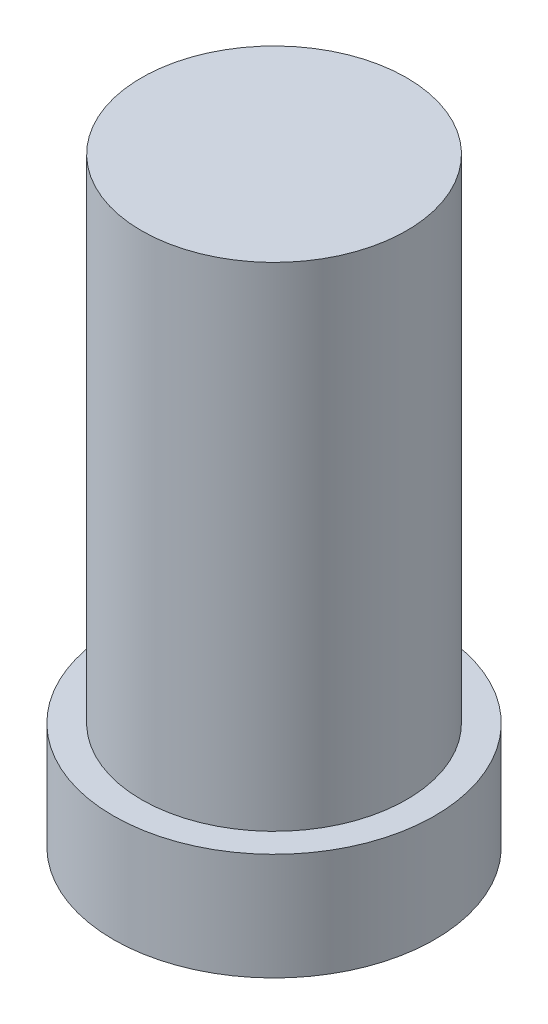
ISO-10303-21;
HEADER;
FILE_DESCRIPTION(('STEP AP214'),'2;1');
FILE_NAME('part.step','',(''),(''),'','','');
FILE_SCHEMA(('AUTOMOTIVE_DESIGN { 1 0 10303 214 1 1 1 1 }'));
ENDSEC;
DATA;
#1=APPLICATION_CONTEXT('core data for automotive mechanical design processes');
#2=APPLICATION_PROTOCOL_DEFINITION('international standard','automotive_design',2000,#1);
#3=PRODUCT_CONTEXT('',#1,'mechanical');
#4=PRODUCT('Part','Part','',(#3));
#5=PRODUCT_RELATED_PRODUCT_CATEGORY('part','',(#4));
#6=PRODUCT_DEFINITION_FORMATION('','',#4);
#7=PRODUCT_DEFINITION_CONTEXT('part definition',#1,'design');
#8=PRODUCT_DEFINITION('design','',#6,#7);
#9=PRODUCT_DEFINITION_SHAPE('','',#8);
#10=(LENGTH_UNIT() NAMED_UNIT(*) SI_UNIT(.MILLI.,.METRE.));
#11=(NAMED_UNIT(*) PLANE_ANGLE_UNIT() SI_UNIT($,.RADIAN.));
#12=(NAMED_UNIT(*) SI_UNIT($,.STERADIAN.) SOLID_ANGLE_UNIT());
#13=UNCERTAINTY_MEASURE_WITH_UNIT(LENGTH_MEASURE(1.E-05),#10,'distance_accuracy_value','');
#14=(GEOMETRIC_REPRESENTATION_CONTEXT(3) GLOBAL_UNCERTAINTY_ASSIGNED_CONTEXT((#13)) GLOBAL_UNIT_ASSIGNED_CONTEXT((#10,
#11,#12)) REPRESENTATION_CONTEXT('',''));
#15=CARTESIAN_POINT('',(0.,0.,0.));
#16=DIRECTION('',(0.,0.,1.));
#17=DIRECTION('',(1.,0.,0.));
#18=AXIS2_PLACEMENT_3D('',#15,#16,#17);
#19=CARTESIAN_POINT('',(0.,2.,0.));
#20=DIRECTION('',(0.,-1.,0.));
#21=DIRECTION('',(0.,0.,-1.));
#22=AXIS2_PLACEMENT_3D('',#19,#20,#21);
#23=CYLINDRICAL_SURFACE('',#22,3.);
#24=CARTESIAN_POINT('',(0.,2.,0.));
#25=DIRECTION('',(0.,1.,0.));
#26=DIRECTION('',(0.,0.,1.));
#27=AXIS2_PLACEMENT_3D('',#24,#25,#26);
#28=CIRCLE('',#27,3.);
#29=CARTESIAN_POINT('',(0.,2.,3.));
#30=VERTEX_POINT('',#29);
#31=EDGE_CURVE('E10',#30,#30,#28,.T.);
#32=ORIENTED_EDGE('',*,*,#31,.F.);
#33=EDGE_LOOP('',(#32));
#34=FACE_BOUND('',#33,.T.);
#35=CARTESIAN_POINT('',(0.,0.,0.));
#36=DIRECTION('',(0.,1.,0.));
#37=DIRECTION('',(0.,0.,1.));
#38=AXIS2_PLACEMENT_3D('',#35,#36,#37);
#39=CIRCLE('',#38,3.);
#40=CARTESIAN_POINT('',(0.,0.,3.));
#41=VERTEX_POINT('',#40);
#42=EDGE_CURVE('E37',#41,#41,#39,.T.);
#43=ORIENTED_EDGE('',*,*,#42,.T.);
#44=EDGE_LOOP('',(#43));
#45=FACE_BOUND('',#44,.T.);
#46=ADVANCED_FACE('F34',(#34,#45),#23,.T.);
#47=CARTESIAN_POINT('',(0.,2.,0.));
#48=DIRECTION('',(0.,1.,0.));
#49=DIRECTION('',(0.,0.,1.));
#50=AXIS2_PLACEMENT_3D('',#47,#48,#49);
#51=PLANE('',#50);
#52=CARTESIAN_POINT('',(0.,2.,0.));
#53=DIRECTION('',(0.,1.,0.));
#54=DIRECTION('',(0.,0.,1.));
#55=AXIS2_PLACEMENT_3D('',#52,#53,#54);
#56=CIRCLE('',#55,2.475);
#57=CARTESIAN_POINT('',(0.,2.,2.475));
#58=VERTEX_POINT('',#57);
#59=EDGE_CURVE('E44',#58,#58,#56,.F.);
#60=ORIENTED_EDGE('',*,*,#59,.T.);
#61=EDGE_LOOP('',(#60));
#62=FACE_BOUND('',#61,.T.);
#63=ORIENTED_EDGE('',*,*,#31,.T.);
#64=EDGE_LOOP('',(#63));
#65=FACE_BOUND('',#64,.T.);
#66=ADVANCED_FACE('F64',(#62,#65),#51,.T.);
#67=CARTESIAN_POINT('',(0.,0.,0.));
#68=DIRECTION('',(0.,1.,0.));
#69=DIRECTION('',(0.,0.,1.));
#70=AXIS2_PLACEMENT_3D('',#67,#68,#69);
#71=PLANE('',#70);
#72=ORIENTED_EDGE('',*,*,#42,.F.);
#73=EDGE_LOOP('',(#72));
#74=FACE_BOUND('',#73,.T.);
#75=ADVANCED_FACE('F56',(#74),#71,.F.);
#76=CARTESIAN_POINT('',(0.,11.2,0.));
#77=DIRECTION('',(0.,-1.,0.));
#78=DIRECTION('',(0.,0.,-1.));
#79=AXIS2_PLACEMENT_3D('',#76,#77,#78);
#80=CYLINDRICAL_SURFACE('',#79,2.475);
#81=ORIENTED_EDGE('',*,*,#59,.F.);
#82=EDGE_LOOP('',(#81));
#83=FACE_BOUND('',#82,.T.);
#84=CARTESIAN_POINT('',(0.,11.2,0.));
#85=DIRECTION('',(0.,1.,0.));
#86=DIRECTION('',(0.,0.,1.));
#87=AXIS2_PLACEMENT_3D('',#84,#85,#86);
#88=CIRCLE('',#87,2.475);
#89=CARTESIAN_POINT('',(0.,11.2,2.475));
#90=VERTEX_POINT('',#89);
#91=EDGE_CURVE('E48',#90,#90,#88,.T.);
#92=ORIENTED_EDGE('',*,*,#91,.F.);
#93=EDGE_LOOP('',(#92));
#94=FACE_BOUND('',#93,.T.);
#95=ADVANCED_FACE('F54',(#83,#94),#80,.T.);
#96=CARTESIAN_POINT('',(0.,11.2,0.));
#97=DIRECTION('',(0.,1.,0.));
#98=DIRECTION('',(0.,0.,1.));
#99=AXIS2_PLACEMENT_3D('',#96,#97,#98);
#100=PLANE('',#99);
#101=ORIENTED_EDGE('',*,*,#91,.T.);
#102=EDGE_LOOP('',(#101));
#103=FACE_BOUND('',#102,.T.);
#104=ADVANCED_FACE('F52',(#103),#100,.T.);
#105=CLOSED_SHELL('',(#46,#66,#75,#95,#104));
#106=MANIFOLD_SOLID_BREP('B2',#105);
#107=ADVANCED_BREP_SHAPE_REPRESENTATION('',(#18,#106),#14);
#108=SHAPE_DEFINITION_REPRESENTATION(#9,#107);
ENDSEC;
END-ISO-10303-21;
